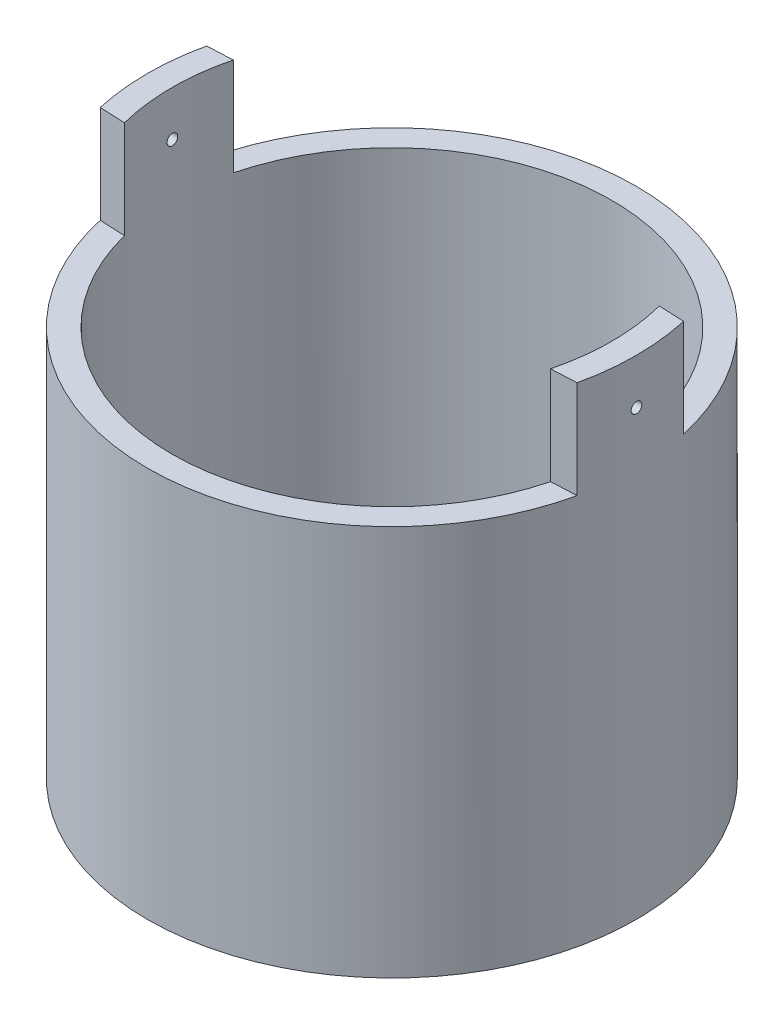
ISO-10303-21;
HEADER;
FILE_DESCRIPTION(('STEP AP214'),'2;1');
FILE_NAME('part.step','',(''),(''),'','','');
FILE_SCHEMA(('AUTOMOTIVE_DESIGN { 1 0 10303 214 1 1 1 1 }'));
ENDSEC;
DATA;
#1=APPLICATION_CONTEXT('core data for automotive mechanical design processes');
#2=APPLICATION_PROTOCOL_DEFINITION('international standard','automotive_design',2000,#1);
#3=PRODUCT_CONTEXT('',#1,'mechanical');
#4=PRODUCT('Part','Part','',(#3));
#5=PRODUCT_RELATED_PRODUCT_CATEGORY('part','',(#4));
#6=PRODUCT_DEFINITION_FORMATION('','',#4);
#7=PRODUCT_DEFINITION_CONTEXT('part definition',#1,'design');
#8=PRODUCT_DEFINITION('design','',#6,#7);
#9=PRODUCT_DEFINITION_SHAPE('','',#8);
#10=(LENGTH_UNIT() NAMED_UNIT(*) SI_UNIT(.MILLI.,.METRE.));
#11=(NAMED_UNIT(*) PLANE_ANGLE_UNIT() SI_UNIT($,.RADIAN.));
#12=(NAMED_UNIT(*) SI_UNIT($,.STERADIAN.) SOLID_ANGLE_UNIT());
#13=UNCERTAINTY_MEASURE_WITH_UNIT(LENGTH_MEASURE(1.E-05),#10,'distance_accuracy_value','');
#14=(GEOMETRIC_REPRESENTATION_CONTEXT(3) GLOBAL_UNCERTAINTY_ASSIGNED_CONTEXT((#13)) GLOBAL_UNIT_ASSIGNED_CONTEXT((#10,
#11,#12)) REPRESENTATION_CONTEXT('',''));
#15=CARTESIAN_POINT('',(0.,0.,0.));
#16=DIRECTION('',(0.,0.,1.));
#17=DIRECTION('',(1.,0.,0.));
#18=AXIS2_PLACEMENT_3D('',#15,#16,#17);
#19=CARTESIAN_POINT('',(0.,101.6,0.));
#20=DIRECTION('',(0.,1.,0.));
#21=DIRECTION('',(0.,0.,1.));
#22=AXIS2_PLACEMENT_3D('',#19,#20,#21);
#23=PLANE('',#22);
#24=CARTESIAN_POINT('',(0.,101.6,0.));
#25=DIRECTION('',(0.,1.,0.));
#26=DIRECTION('',(0.,0.,1.));
#27=AXIS2_PLACEMENT_3D('',#24,#25,#26);
#28=CIRCLE('',#27,57.15);
#29=CARTESIAN_POINT('',(55.372,101.6,-14.1444022850031));
#30=VERTEX_POINT('',#29);
#31=CARTESIAN_POINT('',(-55.372,101.6,-14.1444022850031));
#32=VERTEX_POINT('',#31);
#33=EDGE_CURVE('E180',#30,#32,#28,.T.);
#34=ORIENTED_EDGE('',*,*,#33,.F.);
#35=DIRECTION('',(-0.998857347475172,0.,-0.0477912062503406));
#36=VECTOR('',#35,1.);
#37=CARTESIAN_POINT('',(55.372,101.6,-14.1444022850031));
#38=LINE('',#37,#36);
#39=CARTESIAN_POINT('',(61.976,101.6,-13.8284281102373));
#40=VERTEX_POINT('',#39);
#41=EDGE_CURVE('E239',#40,#30,#38,.T.);
#42=ORIENTED_EDGE('',*,*,#41,.F.);
#43=CARTESIAN_POINT('',(0.,101.6,0.));
#44=DIRECTION('',(0.,1.,0.));
#45=DIRECTION('',(0.,0.,1.));
#46=AXIS2_PLACEMENT_3D('',#43,#44,#45);
#47=CIRCLE('',#46,63.5);
#48=CARTESIAN_POINT('',(-61.976,101.6,-13.8284281102373));
#49=VERTEX_POINT('',#48);
#50=EDGE_CURVE('E139',#40,#49,#47,.T.);
#51=ORIENTED_EDGE('',*,*,#50,.T.);
#52=DIRECTION('',(-0.998857347475172,0.,0.04779120625034));
#53=VECTOR('',#52,1.);
#54=CARTESIAN_POINT('',(-61.976,101.6,-13.8284281102373));
#55=LINE('',#54,#53);
#56=EDGE_CURVE('E144',#32,#49,#55,.T.);
#57=ORIENTED_EDGE('',*,*,#56,.F.);
#58=EDGE_LOOP('',(#34,#42,#51,#57));
#59=FACE_BOUND('',#58,.T.);
#60=ADVANCED_FACE('F39',(#59),#23,.T.);
#61=CARTESIAN_POINT('',(-61.976,101.6,13.8284281102373));
#62=VERTEX_POINT('',#61);
#63=CARTESIAN_POINT('',(61.976,101.6,13.8284281102373));
#64=VERTEX_POINT('',#63);
#65=EDGE_CURVE('E185',#62,#64,#47,.T.);
#66=ORIENTED_EDGE('',*,*,#65,.T.);
#67=DIRECTION('',(0.998857347475172,0.,-0.0477912062503403));
#68=VECTOR('',#67,1.);
#69=CARTESIAN_POINT('',(55.372,101.6,14.1444022850031));
#70=LINE('',#69,#68);
#71=CARTESIAN_POINT('',(55.372,101.6,14.1444022850031));
#72=VERTEX_POINT('',#71);
#73=EDGE_CURVE('E135',#72,#64,#70,.T.);
#74=ORIENTED_EDGE('',*,*,#73,.F.);
#75=CARTESIAN_POINT('',(-55.372,101.6,14.1444022850031));
#76=VERTEX_POINT('',#75);
#77=EDGE_CURVE('E181',#76,#72,#28,.T.);
#78=ORIENTED_EDGE('',*,*,#77,.F.);
#79=DIRECTION('',(0.998857347475172,0.,0.0477912062503403));
#80=VECTOR('',#79,1.);
#81=CARTESIAN_POINT('',(-61.976,101.6,13.8284281102373));
#82=LINE('',#81,#80);
#83=EDGE_CURVE('E71',#62,#76,#82,.T.);
#84=ORIENTED_EDGE('',*,*,#83,.F.);
#85=EDGE_LOOP('',(#66,#74,#78,#84));
#86=FACE_BOUND('',#85,.T.);
#87=ADVANCED_FACE('F263',(#86),#23,.T.);
#88=CARTESIAN_POINT('',(0.,76.2,0.));
#89=DIRECTION('',(0.,-1.,0.));
#90=DIRECTION('',(0.,0.,-1.));
#91=AXIS2_PLACEMENT_3D('',#88,#89,#90);
#92=CYLINDRICAL_SURFACE('',#91,63.5);
#93=CARTESIAN_POINT('',(-63.4829647073842,115.21931920527,-1.47077937195123));
#94=CARTESIAN_POINT('',(-63.4829649170925,115.297331986657,-1.47077591515681));
#95=CARTESIAN_POINT('',(-63.4831185422767,115.375401098312,-1.46418526018484));
#96=CARTESIAN_POINT('',(-63.4837172996637,115.529388529426,-1.43798570784439));
#97=CARTESIAN_POINT('',(-63.4841627813181,115.605304156602,-1.41836120413006));
#98=CARTESIAN_POINT('',(-63.485296902786,115.752731446426,-1.36665361274431));
#99=CARTESIAN_POINT('',(-63.4859854247434,115.824245223933,-1.33457656286518));
#100=CARTESIAN_POINT('',(-63.4875313714612,115.960852664148,-1.25888298148324));
#101=CARTESIAN_POINT('',(-63.4883887546358,116.025947901654,-1.21526929023364));
#102=CARTESIAN_POINT('',(-63.4901808797775,116.147912022489,-1.11772312183544));
#103=CARTESIAN_POINT('',(-63.4911156426295,116.204778673452,-1.06378785368757));
#104=CARTESIAN_POINT('',(-63.4929628617955,116.308652856521,-0.947133921893063));
#105=CARTESIAN_POINT('',(-63.4938753172224,116.35565999712,-0.88441490962106));
#106=CARTESIAN_POINT('',(-63.4955819366929,116.438482961545,-0.751967183493351));
#107=CARTESIAN_POINT('',(-63.4963760881291,116.474297593055,-0.682237723873613));
#108=CARTESIAN_POINT('',(-63.4977640155992,116.533711202493,-0.537753798982038));
#109=CARTESIAN_POINT('',(-63.4983577922382,116.557310217303,-0.462999348882912));
#110=CARTESIAN_POINT('',(-63.4992860621805,116.59161911204,-0.310599660523662));
#111=CARTESIAN_POINT('',(-63.4996205958863,116.602331000532,-0.232954874691712));
#112=CARTESIAN_POINT('',(-63.5000012442132,116.610567548529,-0.0769684573589591));
#113=CARTESIAN_POINT('',(-63.500047359721,116.608092248566,0.00137317199924745));
#114=CARTESIAN_POINT('',(-63.4998544973983,116.590026464947,0.15651375468178));
#115=CARTESIAN_POINT('',(-63.499615573923,116.574438481967,0.233312999290265));
#116=CARTESIAN_POINT('',(-63.498887984922,116.530593483407,0.383204490130935));
#117=CARTESIAN_POINT('',(-63.498399319021,116.502336448791,0.456296730793354));
#118=CARTESIAN_POINT('',(-63.4972352056706,116.433953734111,0.596704537815111));
#119=CARTESIAN_POINT('',(-63.4965597467644,116.393827326034,0.664019749511746));
#120=CARTESIAN_POINT('',(-63.4951054780516,116.302845454613,0.79095909274559));
#121=CARTESIAN_POINT('',(-63.4943266681456,116.251989980957,0.850583216891742));
#122=CARTESIAN_POINT('',(-63.4927597644046,116.140981369302,0.960460508461691));
#123=CARTESIAN_POINT('',(-63.4919716687211,116.080826350288,1.01071177549607));
#124=CARTESIAN_POINT('',(-63.4904806512518,115.952932916896,1.1004023407974));
#125=CARTESIAN_POINT('',(-63.4897777294862,115.885194500706,1.13984163648138));
#126=CARTESIAN_POINT('',(-63.4885405920076,115.744054827638,1.20678919209859));
#127=CARTESIAN_POINT('',(-63.4880063800995,115.670653443095,1.23429718295892));
#128=CARTESIAN_POINT('',(-63.4871699326888,115.520272950025,1.2765991400696));
#129=CARTESIAN_POINT('',(-63.4868676968826,115.443293846182,1.29139312296072));
#130=CARTESIAN_POINT('',(-63.486530939211,115.287958121665,1.30784499600895));
#131=CARTESIAN_POINT('',(-63.4864963685989,115.20960175442,1.30950527804917));
#132=CARTESIAN_POINT('',(-63.4866988922572,115.053722611096,1.29964884883673));
#133=CARTESIAN_POINT('',(-63.4869359863866,114.976199834584,1.28813214442527));
#134=CARTESIAN_POINT('',(-63.487653814155,114.824195374215,1.25225069774117));
#135=CARTESIAN_POINT('',(-63.4881345265495,114.749713425796,1.22788707577325));
#136=CARTESIAN_POINT('',(-63.4892827345872,114.60589680768,1.16700450821196));
#137=CARTESIAN_POINT('',(-63.4899502304042,114.536562142769,1.13048555132129));
#138=CARTESIAN_POINT('',(-63.4913929124932,114.404996944793,1.04632257613725));
#139=CARTESIAN_POINT('',(-63.4921681148115,114.342767472783,0.998676899461541));
#140=CARTESIAN_POINT('',(-63.4937335827857,114.227189838234,0.893615375324416));
#141=CARTESIAN_POINT('',(-63.4945238484626,114.173841687994,0.836199514333427));
#142=CARTESIAN_POINT('',(-63.4960242521264,114.077533417095,0.713217508286191));
#143=CARTESIAN_POINT('',(-63.4967343786027,114.034574787695,0.647650195255195));
#144=CARTESIAN_POINT('',(-63.4979871949173,113.960275327068,0.510232556254644));
#145=CARTESIAN_POINT('',(-63.4985298850537,113.928934475143,0.438382241478661));
#146=CARTESIAN_POINT('',(-63.4993787975204,113.878763514918,0.290445758493135));
#147=CARTESIAN_POINT('',(-63.4996850440183,113.859932128014,0.214360024051559));
#148=CARTESIAN_POINT('',(-63.5000183739547,113.835310198931,0.0601062710330311));
#149=CARTESIAN_POINT('',(-63.5000454572679,113.829519662611,-0.0180617484794858));
#150=CARTESIAN_POINT('',(-63.4998089452234,113.83114378649,-0.174244637706082));
#151=CARTESIAN_POINT('',(-63.4995454068455,113.838555858333,-0.252259534437949));
#152=CARTESIAN_POINT('',(-63.4987489797217,113.866369303255,-0.405937171022538));
#153=CARTESIAN_POINT('',(-63.4982160903944,113.886770704371,-0.481599905797745));
#154=CARTESIAN_POINT('',(-63.4969327750511,113.939984149699,-0.628429212635925));
#155=CARTESIAN_POINT('',(-63.4961823394083,113.972796743156,-0.699595585553926));
#156=CARTESIAN_POINT('',(-63.4945408111034,114.049899462879,-0.835407252536742));
#157=CARTESIAN_POINT('',(-63.4936497237177,114.094189158637,-0.900052791072389));
#158=CARTESIAN_POINT('',(-63.4918201405713,114.192995269429,-1.0209998754314));
#159=CARTESIAN_POINT('',(-63.490881639247,114.247512886651,-1.07730043899384));
#160=CARTESIAN_POINT('',(-63.4890567542825,114.365242474952,-1.17996462741543));
#161=CARTESIAN_POINT('',(-63.4881703836254,114.428456598901,-1.22632578442453));
#162=CARTESIAN_POINT('',(-63.4865444708081,114.561802289011,-1.30779884590625));
#163=CARTESIAN_POINT('',(-63.485805010538,114.631937680769,-1.34290448304512));
#164=CARTESIAN_POINT('',(-63.4845540343314,114.77705405411,-1.40080177814973));
#165=CARTESIAN_POINT('',(-63.4840422459748,114.852029121061,-1.4236081597242));
#166=CARTESIAN_POINT('',(-63.4834389415865,114.976119753696,-1.45019901186818));
#167=CARTESIAN_POINT('',(-63.4832618428377,115.024429372553,-1.45790697155806));
#168=CARTESIAN_POINT('',(-63.4830246600559,115.1215916929,-1.4681982339878));
#169=CARTESIAN_POINT('',(-63.4829645760025,115.170444394295,-1.47078153762423));
#170=CARTESIAN_POINT('',(-63.4829647073842,115.21931920527,-1.47077937195123));
#171=B_SPLINE_CURVE_WITH_KNOTS('',3,(#93,#94,#95,#96,#97,#98,#99,#100,#101,#102,#103,#104,#105,
#106,#107,#108,#109,#110,#111,#112,#113,#114,#115,#116,#117,#118,#119,#120,#121,#122,#123,#124,
#125,#126,#127,#128,#129,#130,#131,#132,#133,#134,#135,#136,#137,#138,#139,#140,#141,#142,#143,
#144,#145,#146,#147,#148,#149,#150,#151,#152,#153,#154,#155,#156,#157,#158,#159,#160,#161,#162,
#163,#164,#165,#166,#167,#168,#169,#170),.UNSPECIFIED.,.T.,.F.,(4,2,2,2,2,2,2,2,2,2,2,2,2,2,2,2,
2,2,2,2,2,2,2,2,2,2,2,2,2,2,2,2,2,2,2,2,2,2,4),(0.,0.233859944263324,0.468000411564756,
0.702027494072429,0.935997014027852,1.1700298899829,1.40407205729837,1.63813914817078,
1.87220553232085,2.10623543054921,2.34026460945024,2.57424916751861,2.80823407713788,
3.04223334127149,3.27623283027436,3.51027971228622,3.74432665021161,3.97837886605199,
4.21243077555184,4.44644005900852,4.68044922097281,4.91443797973758,5.14842695597483,
5.3824508293905,5.61647502688091,5.85053279508485,6.08459014630834,6.31862357063275,
6.5526571001096,6.78664475265158,7.02063291025779,7.25463142400269,7.48862116170971,
7.72263841978262,7.95671371475867,8.19091912281899,8.42484353445192,8.57135622592236,
8.71786889176039),.UNSPECIFIED.);
#172=CARTESIAN_POINT('',(-63.4829647073842,115.21931920527,-1.47077937195123));
#173=VERTEX_POINT('',#172);
#174=EDGE_CURVE('E233',#173,#173,#171,.T.);
#175=ORIENTED_EDGE('',*,*,#174,.T.);
#176=EDGE_LOOP('',(#175));
#177=FACE_BOUND('',#176,.T.);
#178=CARTESIAN_POINT('',(63.4829647073851,115.21931920527,-1.47077937195123));
#179=CARTESIAN_POINT('',(63.4829649170936,115.141306423883,-1.47077591515681));
#180=CARTESIAN_POINT('',(63.483118542277,115.063237312227,-1.46418526018484));
#181=CARTESIAN_POINT('',(63.4837172996634,114.909249881114,-1.43798570784439));
#182=CARTESIAN_POINT('',(63.484162781318,114.833334253938,-1.41836120413006));
#183=CARTESIAN_POINT('',(63.4852969027861,114.685906964114,-1.36665361274431));
#184=CARTESIAN_POINT('',(63.4859854247434,114.614393186606,-1.33457656286518));
#185=CARTESIAN_POINT('',(63.4875313714612,114.477785746392,-1.25888298148324));
#186=CARTESIAN_POINT('',(63.4883887546358,114.412690508886,-1.21526929023364));
#187=CARTESIAN_POINT('',(63.4901808797775,114.29072638805,-1.11772312183544));
#188=CARTESIAN_POINT('',(63.4911156426295,114.233859737088,-1.06378785368757));
#189=CARTESIAN_POINT('',(63.4929628617955,114.129985554019,-0.947133921893059));
#190=CARTESIAN_POINT('',(63.4938753172224,114.08297841342,-0.884414909621056));
#191=CARTESIAN_POINT('',(63.4955819366929,114.000155448995,-0.751967183493349));
#192=CARTESIAN_POINT('',(63.4963760881291,113.964340817485,-0.68223772387361));
#193=CARTESIAN_POINT('',(63.4977640155992,113.904927208047,-0.537753798982032));
#194=CARTESIAN_POINT('',(63.4983577922382,113.881328193237,-0.462999348882904));
#195=CARTESIAN_POINT('',(63.4992860621805,113.8470192985,-0.310599660523653));
#196=CARTESIAN_POINT('',(63.4996205958863,113.836307410007,-0.232954874691704));
#197=CARTESIAN_POINT('',(63.5000012442132,113.828070862011,-0.0769684573589526));
#198=CARTESIAN_POINT('',(63.500047359721,113.830546161973,0.00137317199925241));
#199=CARTESIAN_POINT('',(63.4998544973983,113.848611945593,0.156513754681784));
#200=CARTESIAN_POINT('',(63.499615573923,113.864199928573,0.23331299929027));
#201=CARTESIAN_POINT('',(63.498887984922,113.908044927133,0.383204490130937));
#202=CARTESIAN_POINT('',(63.498399319021,113.936301961748,0.456296730793353));
#203=CARTESIAN_POINT('',(63.4972352056706,114.004684676429,0.596704537815115));
#204=CARTESIAN_POINT('',(63.4965597467644,114.044811084506,0.664019749511759));
#205=CARTESIAN_POINT('',(63.4951054780516,114.135792955927,0.790959092745603));
#206=CARTESIAN_POINT('',(63.4943266681456,114.186648429582,0.850583216891745));
#207=CARTESIAN_POINT('',(63.4927597644046,114.297657041238,0.96046050846169));
#208=CARTESIAN_POINT('',(63.4919716687211,114.357812060251,1.01071177549608));
#209=CARTESIAN_POINT('',(63.4904806512518,114.485705493643,1.10040234079741));
#210=CARTESIAN_POINT('',(63.4897777294862,114.553443909834,1.13984163648139));
#211=CARTESIAN_POINT('',(63.4885405920076,114.694583582901,1.20678919209859));
#212=CARTESIAN_POINT('',(63.4880063800995,114.767984967445,1.23429718295892));
#213=CARTESIAN_POINT('',(63.4871699326888,114.918365460515,1.2765991400696));
#214=CARTESIAN_POINT('',(63.4868676968826,114.995344564357,1.29139312296072));
#215=CARTESIAN_POINT('',(63.486530939211,115.150680288875,1.30784499600895));
#216=CARTESIAN_POINT('',(63.4864963685989,115.229036656119,1.30950527804917));
#217=CARTESIAN_POINT('',(63.4866988922572,115.384915799443,1.29964884883674));
#218=CARTESIAN_POINT('',(63.4869359863866,115.462438575956,1.28813214442528));
#219=CARTESIAN_POINT('',(63.487653814155,115.614443036324,1.25225069774117));
#220=CARTESIAN_POINT('',(63.4881345265495,115.688924984744,1.22788707577325));
#221=CARTESIAN_POINT('',(63.4892827345872,115.832741602859,1.16700450821196));
#222=CARTESIAN_POINT('',(63.4899502304042,115.902076267771,1.13048555132129));
#223=CARTESIAN_POINT('',(63.4913929124932,116.033641465747,1.04632257613725));
#224=CARTESIAN_POINT('',(63.4921681148115,116.095870937757,0.998676899461538));
#225=CARTESIAN_POINT('',(63.4937335827857,116.211448572306,0.893615375324412));
#226=CARTESIAN_POINT('',(63.4945238484626,116.264796722546,0.836199514333424));
#227=CARTESIAN_POINT('',(63.4960242521264,116.361104993445,0.71321750828619));
#228=CARTESIAN_POINT('',(63.4967343786027,116.404063622845,0.647650195255195));
#229=CARTESIAN_POINT('',(63.4979871949173,116.478363083472,0.510232556254644));
#230=CARTESIAN_POINT('',(63.4985298850537,116.509703935397,0.43838224147866));
#231=CARTESIAN_POINT('',(63.4993787975204,116.559874895622,0.290445758493135));
#232=CARTESIAN_POINT('',(63.4996850440183,116.578706282525,0.214360024051559));
#233=CARTESIAN_POINT('',(63.5000183739547,116.603328211609,0.0601062710330305));
#234=CARTESIAN_POINT('',(63.5000454572679,116.609118747928,-0.0180617484794875));
#235=CARTESIAN_POINT('',(63.4998089452234,116.60749462405,-0.174244637706084));
#236=CARTESIAN_POINT('',(63.4995454068455,116.600082552207,-0.252259534437951));
#237=CARTESIAN_POINT('',(63.4987489797217,116.572269107285,-0.405937171022539));
#238=CARTESIAN_POINT('',(63.4982160903944,116.551867706169,-0.481599905797747));
#239=CARTESIAN_POINT('',(63.4969327750511,116.498654260841,-0.628429212635928));
#240=CARTESIAN_POINT('',(63.4961823394083,116.465841667384,-0.69959558555393));
#241=CARTESIAN_POINT('',(63.4945408111034,116.388738947661,-0.835407252536746));
#242=CARTESIAN_POINT('',(63.4936497237177,116.344449251902,-0.900052791072392));
#243=CARTESIAN_POINT('',(63.4918201405713,116.24564314111,-1.0209998754314));
#244=CARTESIAN_POINT('',(63.490881639247,116.191125523889,-1.07730043899385));
#245=CARTESIAN_POINT('',(63.4890567542825,116.073395935588,-1.17996462741543));
#246=CARTESIAN_POINT('',(63.4881703836254,116.010181811639,-1.22632578442453));
#247=CARTESIAN_POINT('',(63.4865444708081,115.876836121529,-1.30779884590625));
#248=CARTESIAN_POINT('',(63.485805010538,115.806700729771,-1.34290448304512));
#249=CARTESIAN_POINT('',(63.4845540343314,115.66158435643,-1.40080177814973));
#250=CARTESIAN_POINT('',(63.4840422459749,115.586609289478,-1.4236081597242));
#251=CARTESIAN_POINT('',(63.4834389415864,115.462518656843,-1.45019901186818));
#252=CARTESIAN_POINT('',(63.4832618428375,115.414209037987,-1.45790697155806));
#253=CARTESIAN_POINT('',(63.4830246600561,115.31704671764,-1.46819823398781));
#254=CARTESIAN_POINT('',(63.4829645760032,115.268194016245,-1.47078153762423));
#255=CARTESIAN_POINT('',(63.4829647073851,115.21931920527,-1.47077937195123));
#256=B_SPLINE_CURVE_WITH_KNOTS('',3,(#178,#179,#180,#181,#182,#183,#184,#185,#186,#187,#188,
#189,#190,#191,#192,#193,#194,#195,#196,#197,#198,#199,#200,#201,#202,#203,#204,#205,#206,#207,
#208,#209,#210,#211,#212,#213,#214,#215,#216,#217,#218,#219,#220,#221,#222,#223,#224,#225,#226,
#227,#228,#229,#230,#231,#232,#233,#234,#235,#236,#237,#238,#239,#240,#241,#242,#243,#244,#245,
#246,#247,#248,#249,#250,#251,#252,#253,#254,#255),.UNSPECIFIED.,.T.,.F.,(4,2,2,2,2,2,2,2,2,2,2,
2,2,2,2,2,2,2,2,2,2,2,2,2,2,2,2,2,2,2,2,2,2,2,2,2,2,2,4),(0.,0.233859944263323,
0.468000411564754,0.702027494072427,0.93599701402785,1.17002988998291,1.40407205729837,
1.63813914817078,1.87220553232086,2.10623543054922,2.34026460945024,2.57424916751862,
2.80823407713789,3.0422333412715,3.27623283027437,3.51027971228623,3.74432665021161,
3.97837886605198,4.21243077555183,4.44644005900849,4.68044922097281,4.91443797973756,
5.14842695597482,5.38245082939051,5.6164750268809,5.85053279508485,6.08459014630834,
6.31862357063274,6.5526571001096,6.78664475265158,7.0206329102578,7.25463142400269,
7.48862116170972,7.72263841978264,7.95671371475867,8.19091912281899,8.42484353445192,
8.57135622592239,8.71786889176039),.UNSPECIFIED.);
#257=CARTESIAN_POINT('',(63.4829647073851,115.21931920527,-1.47077937195123));
#258=VERTEX_POINT('',#257);
#259=EDGE_CURVE('E227',#258,#258,#256,.T.);
#260=ORIENTED_EDGE('',*,*,#259,.T.);
#261=EDGE_LOOP('',(#260));
#262=FACE_BOUND('',#261,.T.);
#263=CARTESIAN_POINT('',(0.,0.,0.));
#264=DIRECTION('',(0.,1.,0.));
#265=DIRECTION('',(0.,0.,1.));
#266=AXIS2_PLACEMENT_3D('',#263,#264,#265);
#267=CIRCLE('',#266,63.5);
#268=CARTESIAN_POINT('',(0.,0.,63.5));
#269=VERTEX_POINT('',#268);
#270=EDGE_CURVE('E55',#269,#269,#267,.T.);
#271=ORIENTED_EDGE('',*,*,#270,.T.);
#272=EDGE_LOOP('',(#271));
#273=FACE_BOUND('',#272,.T.);
#274=ORIENTED_EDGE('',*,*,#65,.F.);
#275=DIRECTION('',(0.,-1.,0.));
#276=VECTOR('',#275,1.);
#277=CARTESIAN_POINT('',(-61.976,127.,13.8284281102373));
#278=LINE('',#277,#276);
#279=CARTESIAN_POINT('',(-61.976,127.,13.8284281102373));
#280=VERTEX_POINT('',#279);
#281=EDGE_CURVE('E176',#280,#62,#278,.T.);
#282=ORIENTED_EDGE('',*,*,#281,.F.);
#283=CARTESIAN_POINT('',(0.,127.,0.));
#284=DIRECTION('',(0.,1.,0.));
#285=DIRECTION('',(0.,0.,1.));
#286=AXIS2_PLACEMENT_3D('',#283,#284,#285);
#287=CIRCLE('',#286,63.5);
#288=CARTESIAN_POINT('',(-61.976,127.,-13.8284281102373));
#289=VERTEX_POINT('',#288);
#290=EDGE_CURVE('E149',#289,#280,#287,.T.);
#291=ORIENTED_EDGE('',*,*,#290,.F.);
#292=DIRECTION('',(0.,-1.,0.));
#293=VECTOR('',#292,1.);
#294=CARTESIAN_POINT('',(-61.976,127.,-13.8284281102373));
#295=LINE('',#294,#293);
#296=EDGE_CURVE('E161',#289,#49,#295,.T.);
#297=ORIENTED_EDGE('',*,*,#296,.T.);
#298=ORIENTED_EDGE('',*,*,#50,.F.);
#299=DIRECTION('',(0.,-1.,0.));
#300=VECTOR('',#299,1.);
#301=CARTESIAN_POINT('',(61.976,127.,-13.8284281102373));
#302=LINE('',#301,#300);
#303=CARTESIAN_POINT('',(61.976,127.,-13.8284281102373));
#304=VERTEX_POINT('',#303);
#305=EDGE_CURVE('E118',#304,#40,#302,.T.);
#306=ORIENTED_EDGE('',*,*,#305,.F.);
#307=CARTESIAN_POINT('',(0.,127.,0.));
#308=DIRECTION('',(0.,1.,0.));
#309=DIRECTION('',(0.,0.,-1.));
#310=AXIS2_PLACEMENT_3D('',#307,#308,#309);
#311=CIRCLE('',#310,63.5);
#312=CARTESIAN_POINT('',(61.976,127.,13.8284281102373));
#313=VERTEX_POINT('',#312);
#314=EDGE_CURVE('E126',#313,#304,#311,.T.);
#315=ORIENTED_EDGE('',*,*,#314,.F.);
#316=DIRECTION('',(0.,-1.,0.));
#317=VECTOR('',#316,1.);
#318=CARTESIAN_POINT('',(61.976,127.,13.8284281102373));
#319=LINE('',#318,#317);
#320=EDGE_CURVE('E245',#313,#64,#319,.T.);
#321=ORIENTED_EDGE('',*,*,#320,.T.);
#322=EDGE_LOOP('',(#274,#282,#291,#297,#298,#306,#315,#321));
#323=FACE_BOUND('',#322,.T.);
#324=ADVANCED_FACE('F41',(#177,#262,#273,#323),#92,.T.);
#325=CARTESIAN_POINT('',(0.,0.,0.));
#326=DIRECTION('',(0.,1.,0.));
#327=DIRECTION('',(0.,0.,1.));
#328=AXIS2_PLACEMENT_3D('',#325,#326,#327);
#329=PLANE('',#328);
#330=CARTESIAN_POINT('',(0.,0.,0.));
#331=DIRECTION('',(0.,-1.,0.));
#332=DIRECTION('',(0.,0.,-1.));
#333=AXIS2_PLACEMENT_3D('',#330,#331,#332);
#334=CIRCLE('',#333,25.4);
#335=CARTESIAN_POINT('',(0.,0.,-25.4));
#336=VERTEX_POINT('',#335);
#337=EDGE_CURVE('E11',#336,#336,#334,.T.);
#338=ORIENTED_EDGE('',*,*,#337,.F.);
#339=EDGE_LOOP('',(#338));
#340=FACE_BOUND('',#339,.T.);
#341=ORIENTED_EDGE('',*,*,#270,.F.);
#342=EDGE_LOOP('',(#341));
#343=FACE_BOUND('',#342,.T.);
#344=ADVANCED_FACE('F262',(#340,#343),#329,.F.);
#345=CARTESIAN_POINT('',(0.,6.35000000000001,0.));
#346=DIRECTION('',(0.,1.,0.));
#347=DIRECTION('',(0.,0.,1.));
#348=AXIS2_PLACEMENT_3D('',#345,#346,#347);
#349=CYLINDRICAL_SURFACE('',#348,57.15);
#350=CARTESIAN_POINT('',(-57.1310713013422,115.21931920527,-1.47077937195123));
#351=CARTESIAN_POINT('',(-57.131071534292,115.141309114393,-1.47077591590676));
#352=CARTESIAN_POINT('',(-57.1312422280716,115.063242750641,-1.46418571324732));
#353=CARTESIAN_POINT('',(-57.1319075072892,114.90926091048,-1.43798805764897));
#354=CARTESIAN_POINT('',(-57.1324024806325,114.833348123801,-1.41836501435539));
#355=CARTESIAN_POINT('',(-57.1336625919195,114.685926527702,-1.36666152750461));
#356=CARTESIAN_POINT('',(-57.1344275984744,114.614415596329,-1.33458714158275));
#357=CARTESIAN_POINT('',(-57.1361452714156,114.477813296389,-1.25890008440875));
#358=CARTESIAN_POINT('',(-57.1370978917088,114.412720356935,-1.21529024628363));
#359=CARTESIAN_POINT('',(-57.1390891252625,114.290757438987,-1.11775087165657));
#360=CARTESIAN_POINT('',(-57.140127765069,114.233890013915,-1.06381814266948));
#361=CARTESIAN_POINT('',(-57.1421802704837,114.130013658497,-0.947169195056444));
#362=CARTESIAN_POINT('',(-57.143194135104,114.08300512065,-0.884452626895875));
#363=CARTESIAN_POINT('',(-57.145090473187,114.000177452962,-0.752007361174526));
#364=CARTESIAN_POINT('',(-57.1459729287802,113.964359844168,-0.682277712111201));
#365=CARTESIAN_POINT('',(-57.1475152009991,113.904940508224,-0.537792420802112));
#366=CARTESIAN_POINT('',(-57.1481750183496,113.881338741299,-0.463036794921573));
#367=CARTESIAN_POINT('',(-57.1492065321497,113.847025523887,-0.310636715696705));
#368=CARTESIAN_POINT('',(-57.1495782841452,113.836311588098,-0.23299282230674));
#369=CARTESIAN_POINT('',(-57.150001328777,113.828070759645,-0.077007676559521));
#370=CARTESIAN_POINT('',(-57.1500526224939,113.830543822515,0.00133357344544507));
#371=CARTESIAN_POINT('',(-57.1498384446636,113.848604605409,0.156470214394535));
#372=CARTESIAN_POINT('',(-57.1495730477026,113.864189237174,0.233265964999865));
#373=CARTESIAN_POINT('',(-57.1487647793881,113.908026237433,0.383151073208096));
#374=CARTESIAN_POINT('',(-57.1482219075888,113.93627862628,0.456240424855444));
#375=CARTESIAN_POINT('',(-57.1469286176268,114.004651295344,0.596644383292428));
#376=CARTESIAN_POINT('',(-57.1461781837408,114.044772474669,0.663958552090739));
#377=CARTESIAN_POINT('',(-57.1445624538345,114.135743165103,0.790896945077914));
#378=CARTESIAN_POINT('',(-57.1436971576671,114.186592689957,0.850521159414499));
#379=CARTESIAN_POINT('',(-57.141956161884,114.297591715422,0.960402728347279));
#380=CARTESIAN_POINT('',(-57.1410804597216,114.357743537887,1.01065773746422));
#381=CARTESIAN_POINT('',(-57.1394236493916,114.485631422642,1.10035637265939));
#382=CARTESIAN_POINT('',(-57.1386425412491,114.553367486941,1.13979999587346));
#383=CARTESIAN_POINT('',(-57.1372677427804,114.694503923677,1.20675679158578));
#384=CARTESIAN_POINT('',(-57.1366740576869,114.767904454192,1.23426963098864));
#385=CARTESIAN_POINT('',(-57.1357444340698,114.918284383408,1.27658123146758));
#386=CARTESIAN_POINT('',(-57.1354084951323,114.995263776363,1.29138001295796));
#387=CARTESIAN_POINT('',(-57.1350341012935,115.150597697313,1.30784079649427));
#388=CARTESIAN_POINT('',(-57.1349955795252,115.228951912244,1.30950575136209));
#389=CARTESIAN_POINT('',(-57.1352203898617,115.384827524233,1.29965931030737));
#390=CARTESIAN_POINT('',(-57.1354837217698,115.462348921834,1.28814792297165));
#391=CARTESIAN_POINT('',(-57.1362811010838,115.61434982336,1.2522780789397));
#392=CARTESIAN_POINT('',(-57.1368151193274,115.688829654033,1.22792100615949));
#393=CARTESIAN_POINT('',(-57.1380907066572,115.832643211926,1.16705257829293));
#394=CARTESIAN_POINT('',(-57.1388322759877,115.901976933086,1.13054120889395));
#395=CARTESIAN_POINT('',(-57.1404351289264,116.033544106212,1.04639273445997));
#396=CARTESIAN_POINT('',(-57.1412964345521,116.095776248476,0.998753582115143));
#397=CARTESIAN_POINT('',(-57.1430358304139,116.211360503391,0.893704807359265));
#398=CARTESIAN_POINT('',(-57.1439139206771,116.2647126017,0.836295169168317));
#399=CARTESIAN_POINT('',(-57.145581152909,116.361031744813,0.713322790947779));
#400=CARTESIAN_POINT('',(-57.1463702790995,116.403996949012,0.647758609008739));
#401=CARTESIAN_POINT('',(-57.1477625290986,116.478309943964,0.5103457144834));
#402=CARTESIAN_POINT('',(-57.1483656532702,116.509657757387,0.438497014160983));
#403=CARTESIAN_POINT('',(-57.1493091703527,116.55984204841,0.290563967226226));
#404=CARTESIAN_POINT('',(-57.1496495963705,116.578680102527,0.214480155645411));
#405=CARTESIAN_POINT('',(-57.1500202845851,116.603315619724,0.0602289720192637));
#406=CARTESIAN_POINT('',(-57.1500505467411,116.609113081085,-0.0179384003009577));
#407=CARTESIAN_POINT('',(-57.1497880994029,116.607502883108,-0.174117491888123));
#408=CARTESIAN_POINT('',(-57.1494954679275,116.600098413404,-0.252129244194722));
#409=CARTESIAN_POINT('',(-57.148610932776,116.572301319853,-0.405801765666485));
#410=CARTESIAN_POINT('',(-57.1480190284436,116.551908667531,-0.48146252967703));
#411=CARTESIAN_POINT('',(-57.1465934863739,116.498713619971,-0.62828973466698));
#412=CARTESIAN_POINT('',(-57.1457598365102,116.465910602189,-0.699455949976311));
#413=CARTESIAN_POINT('',(-57.1439361958837,116.388827724821,-0.83526905010434));
#414=CARTESIAN_POINT('',(-57.1429462109213,116.344548290994,-0.899916176648971));
#415=CARTESIAN_POINT('',(-57.1409134271784,116.245760360683,-1.02087174024029));
#416=CARTESIAN_POINT('',(-57.1398706194632,116.191250129474,-1.07717876024497));
#417=CARTESIAN_POINT('',(-57.1378428195988,116.073534070351,-1.17985715976033));
#418=CARTESIAN_POINT('',(-57.1368578418447,116.010326090358,-1.22622607300613));
#419=CARTESIAN_POINT('',(-57.1350509322349,115.876989734547,-1.30771653396632));
#420=CARTESIAN_POINT('',(-57.1342290943538,115.806857404667,-1.34283160615902));
#421=CARTESIAN_POINT('',(-57.1328386499669,115.661744978437,-1.40074801644744));
#422=CARTESIAN_POINT('',(-57.1322697410065,115.586770795615,-1.42356406879818));
#423=CARTESIAN_POINT('',(-57.1315988507795,115.462654409473,-1.4501758601501));
#424=CARTESIAN_POINT('',(-57.131401842786,115.414318231986,-1.45789248058772));
#425=CARTESIAN_POINT('',(-57.1311379950665,115.317101809171,-1.46819531918166));
#426=CARTESIAN_POINT('',(-57.1310711553124,115.268221563962,-1.47078153844949));
#427=CARTESIAN_POINT('',(-57.1310713013422,115.21931920527,-1.47077937195123));
#428=B_SPLINE_CURVE_WITH_KNOTS('',3,(#350,#351,#352,#353,#354,#355,#356,#357,#358,#359,#360,
#361,#362,#363,#364,#365,#366,#367,#368,#369,#370,#371,#372,#373,#374,#375,#376,#377,#378,#379,
#380,#381,#382,#383,#384,#385,#386,#387,#388,#389,#390,#391,#392,#393,#394,#395,#396,#397,#398,
#399,#400,#401,#402,#403,#404,#405,#406,#407,#408,#409,#410,#411,#412,#413,#414,#415,#416,#417,
#418,#419,#420,#421,#422,#423,#424,#425,#426,#427),.UNSPECIFIED.,.T.,.F.,(4,2,2,2,2,2,2,2,2,2,2,
2,2,2,2,2,2,2,2,2,2,2,2,2,2,2,2,2,2,2,2,2,2,2,2,2,2,2,4),(0.,0.233851770531822,
0.467983788063989,0.702002041757586,0.935962873443076,1.16999617774076,1.40403879755482,
1.63811321414034,1.8721868685864,2.10621537681434,2.34024309592804,2.57421570830326,
2.80818869662067,3.04217941385161,3.27617043086571,3.51021994657552,3.74426952429008,
3.97832563601131,4.21238137192036,4.44638448458262,4.68038744474876,4.91436520000743,
5.1483432307941,5.38236434323985,5.61638583364684,5.85044876338198,6.08451123636667,
6.31854420650652,6.55257720752312,6.78655367301489,7.02053065147164,7.25451936852476,
7.48849940615092,7.72251915311914,7.9565969079286,8.19080911153592,8.42474048380844,
8.57133569363908,8.71793087170956),.UNSPECIFIED.);
#429=CARTESIAN_POINT('',(-57.1310713013422,115.21931920527,-1.47077937195123));
#430=VERTEX_POINT('',#429);
#431=EDGE_CURVE('E44',#430,#430,#428,.T.);
#432=ORIENTED_EDGE('',*,*,#431,.T.);
#433=EDGE_LOOP('',(#432));
#434=FACE_BOUND('',#433,.T.);
#435=CARTESIAN_POINT('',(57.1310713013422,115.21931920527,-1.47077937195123));
#436=CARTESIAN_POINT('',(57.131071534292,115.297329296147,-1.47077591590676));
#437=CARTESIAN_POINT('',(57.1312422280716,115.375395659899,-1.46418571324732));
#438=CARTESIAN_POINT('',(57.1319075072892,115.52937750006,-1.43798805764897));
#439=CARTESIAN_POINT('',(57.1324024806325,115.605290286738,-1.41836501435539));
#440=CARTESIAN_POINT('',(57.1336625919195,115.752711882838,-1.36666152750461));
#441=CARTESIAN_POINT('',(57.1344275984744,115.824222814211,-1.33458714158276));
#442=CARTESIAN_POINT('',(57.1361452714156,115.96082511415,-1.25890008440876));
#443=CARTESIAN_POINT('',(57.1370978917088,116.025918053605,-1.21529024628363));
#444=CARTESIAN_POINT('',(57.1390891252625,116.147880971553,-1.11775087165657));
#445=CARTESIAN_POINT('',(57.140127765069,116.204748396625,-1.06381814266948));
#446=CARTESIAN_POINT('',(57.1421802704837,116.308624752043,-0.947169195056444));
#447=CARTESIAN_POINT('',(57.143194135104,116.355633289889,-0.884452626895875));
#448=CARTESIAN_POINT('',(57.145090473187,116.438460957578,-0.752007361174526));
#449=CARTESIAN_POINT('',(57.1459729287802,116.474278566371,-0.682277712111201));
#450=CARTESIAN_POINT('',(57.1475152009991,116.533697902315,-0.537792420802112));
#451=CARTESIAN_POINT('',(57.1481750183496,116.55729966924,-0.463036794921573));
#452=CARTESIAN_POINT('',(57.1492065321497,116.591612886653,-0.310636715696705));
#453=CARTESIAN_POINT('',(57.1495782841452,116.602326822442,-0.232992822306741));
#454=CARTESIAN_POINT('',(57.150001328777,116.610567650895,-0.0770076765595215));
#455=CARTESIAN_POINT('',(57.1500526224939,116.608094588025,0.00133357344544478));
#456=CARTESIAN_POINT('',(57.1498384446636,116.590033805131,0.156470214394536));
#457=CARTESIAN_POINT('',(57.1495730477026,116.574449173365,0.233265964999868));
#458=CARTESIAN_POINT('',(57.1487647793881,116.530612173107,0.383151073208098));
#459=CARTESIAN_POINT('',(57.1482219075888,116.50235978426,0.456240424855446));
#460=CARTESIAN_POINT('',(57.1469286176268,116.433987115195,0.596644383292425));
#461=CARTESIAN_POINT('',(57.1461781837408,116.39386593587,0.663958552090734));
#462=CARTESIAN_POINT('',(57.1445624538345,116.302895245437,0.790896945077909));
#463=CARTESIAN_POINT('',(57.1436971576671,116.252045720583,0.850521159414497));
#464=CARTESIAN_POINT('',(57.141956161884,116.141046695118,0.960402728347279));
#465=CARTESIAN_POINT('',(57.1410804597216,116.080894872653,1.01065773746422));
#466=CARTESIAN_POINT('',(57.1394236493916,115.953006987898,1.10035637265939));
#467=CARTESIAN_POINT('',(57.1386425412491,115.885270923599,1.13979999587346));
#468=CARTESIAN_POINT('',(57.1372677427804,115.744134486863,1.20675679158579));
#469=CARTESIAN_POINT('',(57.1366740576869,115.670733956348,1.23426963098864));
#470=CARTESIAN_POINT('',(57.1357444340698,115.520354027132,1.27658123146759));
#471=CARTESIAN_POINT('',(57.1354084951323,115.443374634177,1.29138001295796));
#472=CARTESIAN_POINT('',(57.1350341012935,115.288040713226,1.30784079649427));
#473=CARTESIAN_POINT('',(57.1349955795252,115.209686498296,1.30950575136209));
#474=CARTESIAN_POINT('',(57.1352203898617,115.053810886307,1.29965931030737));
#475=CARTESIAN_POINT('',(57.1354837217698,114.976289488705,1.28814792297165));
#476=CARTESIAN_POINT('',(57.1362811010838,114.824288587179,1.2522780789397));
#477=CARTESIAN_POINT('',(57.1368151193274,114.749808756506,1.22792100615948));
#478=CARTESIAN_POINT('',(57.1380907066572,114.605995198613,1.16705257829292));
#479=CARTESIAN_POINT('',(57.1388322759877,114.536661477454,1.13054120889394));
#480=CARTESIAN_POINT('',(57.1404351289264,114.405094304328,1.04639273445997));
#481=CARTESIAN_POINT('',(57.1412964345521,114.342862162064,0.998753582115144));
#482=CARTESIAN_POINT('',(57.1430358304139,114.227277907148,0.893704807359264));
#483=CARTESIAN_POINT('',(57.1439139206771,114.17392580884,0.836295169168315));
#484=CARTESIAN_POINT('',(57.145581152909,114.077606665727,0.713322790947777));
#485=CARTESIAN_POINT('',(57.1463702790995,114.034641461528,0.647758609008737));
#486=CARTESIAN_POINT('',(57.1477625290986,113.960328466576,0.510345714483397));
#487=CARTESIAN_POINT('',(57.1483656532702,113.928980653153,0.438497014160981));
#488=CARTESIAN_POINT('',(57.1493091703527,113.87879636213,0.290563967226224));
#489=CARTESIAN_POINT('',(57.1496495963705,113.859958308013,0.214480155645409));
#490=CARTESIAN_POINT('',(57.1500202845851,113.835322790815,0.0602289720192625));
#491=CARTESIAN_POINT('',(57.1500505467411,113.829525329455,-0.0179384003009583));
#492=CARTESIAN_POINT('',(57.1497880994029,113.831135527432,-0.174117491888123));
#493=CARTESIAN_POINT('',(57.1494954679275,113.838539997136,-0.252129244194722));
#494=CARTESIAN_POINT('',(57.148610932776,113.866337090687,-0.405801765666485));
#495=CARTESIAN_POINT('',(57.1480190284436,113.886729743009,-0.48146252967703));
#496=CARTESIAN_POINT('',(57.1465934863739,113.939924790568,-0.628289734666981));
#497=CARTESIAN_POINT('',(57.1457598365102,113.97272780835,-0.699455949976311));
#498=CARTESIAN_POINT('',(57.1439361958837,114.049810685719,-0.83526905010434));
#499=CARTESIAN_POINT('',(57.1429462109213,114.094090119546,-0.899916176648971));
#500=CARTESIAN_POINT('',(57.1409134271784,114.192878049857,-1.02087174024029));
#501=CARTESIAN_POINT('',(57.1398706194632,114.247388281066,-1.07717876024497));
#502=CARTESIAN_POINT('',(57.1378428195988,114.365104340189,-1.17985715976033));
#503=CARTESIAN_POINT('',(57.1368578418447,114.428312320181,-1.22622607300613));
#504=CARTESIAN_POINT('',(57.1350509322349,114.561648675993,-1.30771653396632));
#505=CARTESIAN_POINT('',(57.1342290943538,114.631781005873,-1.34283160615902));
#506=CARTESIAN_POINT('',(57.1328386499669,114.776893432103,-1.40074801644744));
#507=CARTESIAN_POINT('',(57.1322697410065,114.851867614925,-1.42356406879818));
#508=CARTESIAN_POINT('',(57.1315988507795,114.975984001067,-1.4501758601501));
#509=CARTESIAN_POINT('',(57.131401842786,115.024320178554,-1.45789248058772));
#510=CARTESIAN_POINT('',(57.1311379950665,115.121536601368,-1.46819531918166));
#511=CARTESIAN_POINT('',(57.1310711553124,115.170416846577,-1.47078153844949));
#512=CARTESIAN_POINT('',(57.1310713013422,115.21931920527,-1.47077937195123));
#513=B_SPLINE_CURVE_WITH_KNOTS('',3,(#435,#436,#437,#438,#439,#440,#441,#442,#443,#444,#445,
#446,#447,#448,#449,#450,#451,#452,#453,#454,#455,#456,#457,#458,#459,#460,#461,#462,#463,#464,
#465,#466,#467,#468,#469,#470,#471,#472,#473,#474,#475,#476,#477,#478,#479,#480,#481,#482,#483,
#484,#485,#486,#487,#488,#489,#490,#491,#492,#493,#494,#495,#496,#497,#498,#499,#500,#501,#502,
#503,#504,#505,#506,#507,#508,#509,#510,#511,#512),.UNSPECIFIED.,.T.,.F.,(4,2,2,2,2,2,2,2,2,2,2,
2,2,2,2,2,2,2,2,2,2,2,2,2,2,2,2,2,2,2,2,2,2,2,2,2,2,2,4),(0.,0.233851770531822,
0.467983788063989,0.702002041757569,0.935962873443077,1.16999617774076,1.40403879755482,
1.63811321414034,1.8721868685864,2.10621537681434,2.34024309592804,2.57421570830326,
2.80818869662067,3.04217941385161,3.27617043086571,3.51021994657552,3.74426952429008,
3.97832563601133,4.21238137192036,4.4463844845826,4.68038744474876,4.91436520000744,
5.1483432307941,5.38236434323985,5.61638583364684,5.85044876338199,6.08451123636667,
6.31854420650652,6.55257720752312,6.78655367301489,7.02053065147164,7.25451936852476,
7.48849940615092,7.72251915311915,7.9565969079286,8.19080911153592,8.42474048380844,
8.57133569363908,8.71793087170956),.UNSPECIFIED.);
#514=CARTESIAN_POINT('',(57.1310713013422,115.21931920527,-1.47077937195123));
#515=VERTEX_POINT('',#514);
#516=EDGE_CURVE('E206',#515,#515,#513,.T.);
#517=ORIENTED_EDGE('',*,*,#516,.T.);
#518=EDGE_LOOP('',(#517));
#519=FACE_BOUND('',#518,.T.);
#520=ORIENTED_EDGE('',*,*,#77,.T.);
#521=DIRECTION('',(0.,-1.,0.));
#522=VECTOR('',#521,1.);
#523=CARTESIAN_POINT('',(55.372,127.,14.1444022850031));
#524=LINE('',#523,#522);
#525=CARTESIAN_POINT('',(55.372,127.,14.1444022850031));
#526=VERTEX_POINT('',#525);
#527=EDGE_CURVE('E63',#526,#72,#524,.T.);
#528=ORIENTED_EDGE('',*,*,#527,.F.);
#529=CARTESIAN_POINT('',(0.,127.,0.));
#530=DIRECTION('',(0.,-1.,0.));
#531=DIRECTION('',(0.,0.,-1.));
#532=AXIS2_PLACEMENT_3D('',#529,#530,#531);
#533=CIRCLE('',#532,57.15);
#534=CARTESIAN_POINT('',(55.372,127.,-14.1444022850031));
#535=VERTEX_POINT('',#534);
#536=EDGE_CURVE('E125',#535,#526,#533,.T.);
#537=ORIENTED_EDGE('',*,*,#536,.F.);
#538=DIRECTION('',(0.,-1.,0.));
#539=VECTOR('',#538,1.);
#540=CARTESIAN_POINT('',(55.372,127.,-14.1444022850031));
#541=LINE('',#540,#539);
#542=EDGE_CURVE('E121',#535,#30,#541,.T.);
#543=ORIENTED_EDGE('',*,*,#542,.T.);
#544=ORIENTED_EDGE('',*,*,#33,.T.);
#545=DIRECTION('',(0.,-1.,0.));
#546=VECTOR('',#545,1.);
#547=CARTESIAN_POINT('',(-55.372,127.,-14.1444022850031));
#548=LINE('',#547,#546);
#549=CARTESIAN_POINT('',(-55.372,127.,-14.1444022850031));
#550=VERTEX_POINT('',#549);
#551=EDGE_CURVE('E168',#550,#32,#548,.T.);
#552=ORIENTED_EDGE('',*,*,#551,.F.);
#553=CARTESIAN_POINT('',(0.,127.,0.));
#554=DIRECTION('',(0.,-1.,0.));
#555=DIRECTION('',(0.,0.,1.));
#556=AXIS2_PLACEMENT_3D('',#553,#554,#555);
#557=CIRCLE('',#556,57.15);
#558=CARTESIAN_POINT('',(-55.372,127.,14.1444022850031));
#559=VERTEX_POINT('',#558);
#560=EDGE_CURVE('E156',#559,#550,#557,.T.);
#561=ORIENTED_EDGE('',*,*,#560,.F.);
#562=DIRECTION('',(0.,-1.,0.));
#563=VECTOR('',#562,1.);
#564=CARTESIAN_POINT('',(-55.372,127.,14.1444022850031));
#565=LINE('',#564,#563);
#566=EDGE_CURVE('E172',#559,#76,#565,.T.);
#567=ORIENTED_EDGE('',*,*,#566,.T.);
#568=EDGE_LOOP('',(#520,#528,#537,#543,#544,#552,#561,#567));
#569=FACE_BOUND('',#568,.T.);
#570=CARTESIAN_POINT('',(0.,6.35000000000001,0.));
#571=DIRECTION('',(0.,1.,0.));
#572=DIRECTION('',(0.,0.,1.));
#573=AXIS2_PLACEMENT_3D('',#570,#571,#572);
#574=CIRCLE('',#573,57.15);
#575=CARTESIAN_POINT('',(0.,6.35000000000001,57.15));
#576=VERTEX_POINT('',#575);
#577=EDGE_CURVE('E199',#576,#576,#574,.T.);
#578=ORIENTED_EDGE('',*,*,#577,.F.);
#579=EDGE_LOOP('',(#578));
#580=FACE_BOUND('',#579,.T.);
#581=ADVANCED_FACE('F212',(#434,#519,#569,#580),#349,.F.);
#582=CARTESIAN_POINT('',(0.,6.35000000000001,0.));
#583=DIRECTION('',(0.,1.,0.));
#584=DIRECTION('',(0.,0.,1.));
#585=AXIS2_PLACEMENT_3D('',#582,#583,#584);
#586=PLANE('',#585);
#587=CARTESIAN_POINT('',(0.,6.34999999999986,0.));
#588=DIRECTION('',(0.,1.,0.));
#589=DIRECTION('',(0.,0.,1.));
#590=AXIS2_PLACEMENT_3D('',#587,#588,#589);
#591=CIRCLE('',#590,22.225);
#592=CARTESIAN_POINT('',(0.,6.34999999999986,22.225));
#593=VERTEX_POINT('',#592);
#594=EDGE_CURVE('E192',#593,#593,#591,.T.);
#595=ORIENTED_EDGE('',*,*,#594,.F.);
#596=EDGE_LOOP('',(#595));
#597=FACE_BOUND('',#596,.T.);
#598=ORIENTED_EDGE('',*,*,#577,.T.);
#599=EDGE_LOOP('',(#598));
#600=FACE_BOUND('',#599,.T.);
#601=ADVANCED_FACE('F273',(#597,#600),#586,.T.);
#602=CARTESIAN_POINT('',(0.,-25.4,0.));
#603=DIRECTION('',(0.,1.,0.));
#604=DIRECTION('',(0.,0.,1.));
#605=AXIS2_PLACEMENT_3D('',#602,#603,#604);
#606=CYLINDRICAL_SURFACE('',#605,25.4);
#607=CARTESIAN_POINT('',(0.,-25.4,0.));
#608=DIRECTION('',(0.,-1.,0.));
#609=DIRECTION('',(0.,0.,-1.));
#610=AXIS2_PLACEMENT_3D('',#607,#608,#609);
#611=CIRCLE('',#610,25.4);
#612=CARTESIAN_POINT('',(0.,-25.4,-25.4));
#613=VERTEX_POINT('',#612);
#614=EDGE_CURVE('E196',#613,#613,#611,.T.);
#615=ORIENTED_EDGE('',*,*,#614,.F.);
#616=EDGE_LOOP('',(#615));
#617=FACE_BOUND('',#616,.T.);
#618=ORIENTED_EDGE('',*,*,#337,.T.);
#619=EDGE_LOOP('',(#618));
#620=FACE_BOUND('',#619,.T.);
#621=ADVANCED_FACE('F293',(#617,#620),#606,.T.);
#622=CARTESIAN_POINT('',(0.,-25.4,0.));
#623=DIRECTION('',(0.,-1.,0.));
#624=DIRECTION('',(0.,0.,-1.));
#625=AXIS2_PLACEMENT_3D('',#622,#623,#624);
#626=PLANE('',#625);
#627=CARTESIAN_POINT('',(0.,-25.4,0.));
#628=DIRECTION('',(0.,-1.,0.));
#629=DIRECTION('',(0.,0.,-1.));
#630=AXIS2_PLACEMENT_3D('',#627,#628,#629);
#631=CIRCLE('',#630,22.225);
#632=CARTESIAN_POINT('',(0.,-25.4,-22.225));
#633=VERTEX_POINT('',#632);
#634=EDGE_CURVE('E188',#633,#633,#631,.T.);
#635=ORIENTED_EDGE('',*,*,#634,.F.);
#636=EDGE_LOOP('',(#635));
#637=FACE_BOUND('',#636,.T.);
#638=ORIENTED_EDGE('',*,*,#614,.T.);
#639=EDGE_LOOP('',(#638));
#640=FACE_BOUND('',#639,.T.);
#641=ADVANCED_FACE('F289',(#637,#640),#626,.T.);
#642=CARTESIAN_POINT('',(0.,2489.2,0.));
#643=DIRECTION('',(0.,-1.,0.));
#644=DIRECTION('',(0.,0.,-1.));
#645=AXIS2_PLACEMENT_3D('',#642,#643,#644);
#646=CYLINDRICAL_SURFACE('',#645,22.225);
#647=ORIENTED_EDGE('',*,*,#594,.T.);
#648=EDGE_LOOP('',(#647));
#649=FACE_BOUND('',#648,.T.);
#650=ORIENTED_EDGE('',*,*,#634,.T.);
#651=EDGE_LOOP('',(#650));
#652=FACE_BOUND('',#651,.T.);
#653=ADVANCED_FACE('F286',(#649,#652),#646,.F.);
#654=CARTESIAN_POINT('',(-61.976,127.,13.8284281102373));
#655=DIRECTION('',(0.0477912062503403,0.,-0.998857347475172));
#656=DIRECTION('',(-0.998857347475173,0.,-0.0477912062503403));
#657=AXIS2_PLACEMENT_3D('',#654,#655,#656);
#658=PLANE('',#657);
#659=ORIENTED_EDGE('',*,*,#83,.T.);
#660=ORIENTED_EDGE('',*,*,#566,.F.);
#661=DIRECTION('',(0.998857347475172,0.,0.0477912062503403));
#662=VECTOR('',#661,1.);
#663=CARTESIAN_POINT('',(-61.976,127.,13.8284281102373));
#664=LINE('',#663,#662);
#665=EDGE_CURVE('E153',#280,#559,#664,.T.);
#666=ORIENTED_EDGE('',*,*,#665,.F.);
#667=ORIENTED_EDGE('',*,*,#281,.T.);
#668=EDGE_LOOP('',(#659,#660,#666,#667));
#669=FACE_BOUND('',#668,.T.);
#670=ADVANCED_FACE('F284',(#669),#658,.F.);
#671=CARTESIAN_POINT('',(-61.976,127.,-13.8284281102373));
#672=DIRECTION('',(0.04779120625034,0.,0.998857347475172));
#673=DIRECTION('',(0.998857347475173,0.,-0.0477912062503401));
#674=AXIS2_PLACEMENT_3D('',#671,#672,#673);
#675=PLANE('',#674);
#676=ORIENTED_EDGE('',*,*,#56,.T.);
#677=ORIENTED_EDGE('',*,*,#296,.F.);
#678=DIRECTION('',(-0.998857347475172,0.,0.04779120625034));
#679=VECTOR('',#678,1.);
#680=CARTESIAN_POINT('',(-61.976,127.,-13.8284281102373));
#681=LINE('',#680,#679);
#682=EDGE_CURVE('E159',#550,#289,#681,.T.);
#683=ORIENTED_EDGE('',*,*,#682,.F.);
#684=ORIENTED_EDGE('',*,*,#551,.T.);
#685=EDGE_LOOP('',(#676,#677,#683,#684));
#686=FACE_BOUND('',#685,.T.);
#687=ADVANCED_FACE('F330',(#686),#675,.F.);
#688=CARTESIAN_POINT('',(0.,127.,0.));
#689=DIRECTION('',(0.,1.,0.));
#690=DIRECTION('',(0.,0.,1.));
#691=AXIS2_PLACEMENT_3D('',#688,#689,#690);
#692=PLANE('',#691);
#693=ORIENTED_EDGE('',*,*,#290,.T.);
#694=ORIENTED_EDGE('',*,*,#665,.T.);
#695=ORIENTED_EDGE('',*,*,#560,.T.);
#696=ORIENTED_EDGE('',*,*,#682,.T.);
#697=EDGE_LOOP('',(#693,#694,#695,#696));
#698=FACE_BOUND('',#697,.T.);
#699=ADVANCED_FACE('F337',(#698),#692,.T.);
#700=CARTESIAN_POINT('',(55.372,127.,-14.1444022850031));
#701=DIRECTION('',(-0.0477912062503406,0.,0.998857347475172));
#702=DIRECTION('',(0.998857347475173,0.,0.0477912062503406));
#703=AXIS2_PLACEMENT_3D('',#700,#701,#702);
#704=PLANE('',#703);
#705=ORIENTED_EDGE('',*,*,#41,.T.);
#706=ORIENTED_EDGE('',*,*,#542,.F.);
#707=DIRECTION('',(-0.998857347475172,0.,-0.0477912062503406));
#708=VECTOR('',#707,1.);
#709=CARTESIAN_POINT('',(55.372,127.,-14.1444022850031));
#710=LINE('',#709,#708);
#711=EDGE_CURVE('E114',#304,#535,#710,.T.);
#712=ORIENTED_EDGE('',*,*,#711,.F.);
#713=ORIENTED_EDGE('',*,*,#305,.T.);
#714=EDGE_LOOP('',(#705,#706,#712,#713));
#715=FACE_BOUND('',#714,.T.);
#716=ADVANCED_FACE('F116',(#715),#704,.F.);
#717=CARTESIAN_POINT('',(55.372,127.,14.1444022850031));
#718=DIRECTION('',(-0.0477912062503403,0.,-0.998857347475172));
#719=DIRECTION('',(-0.998857347475173,0.,0.0477912062503403));
#720=AXIS2_PLACEMENT_3D('',#717,#718,#719);
#721=PLANE('',#720);
#722=ORIENTED_EDGE('',*,*,#73,.T.);
#723=ORIENTED_EDGE('',*,*,#320,.F.);
#724=DIRECTION('',(0.998857347475172,0.,-0.0477912062503403));
#725=VECTOR('',#724,1.);
#726=CARTESIAN_POINT('',(55.372,127.,14.1444022850031));
#727=LINE('',#726,#725);
#728=EDGE_CURVE('E130',#526,#313,#727,.T.);
#729=ORIENTED_EDGE('',*,*,#728,.F.);
#730=ORIENTED_EDGE('',*,*,#527,.T.);
#731=EDGE_LOOP('',(#722,#723,#729,#730));
#732=FACE_BOUND('',#731,.T.);
#733=ADVANCED_FACE('F351',(#732),#721,.F.);
#734=CARTESIAN_POINT('',(0.,127.,0.));
#735=DIRECTION('',(0.,-1.,0.));
#736=DIRECTION('',(0.,0.,-1.));
#737=AXIS2_PLACEMENT_3D('',#734,#735,#736);
#738=PLANE('',#737);
#739=ORIENTED_EDGE('',*,*,#314,.T.);
#740=ORIENTED_EDGE('',*,*,#711,.T.);
#741=ORIENTED_EDGE('',*,*,#536,.T.);
#742=ORIENTED_EDGE('',*,*,#728,.T.);
#743=EDGE_LOOP('',(#739,#740,#741,#742));
#744=FACE_BOUND('',#743,.T.);
#745=ADVANCED_FACE('F129',(#744),#738,.F.);
#746=CARTESIAN_POINT('',(-2413.,115.21931920527,-0.081716871951229));
#747=DIRECTION('',(1.,0.,0.));
#748=DIRECTION('',(0.,0.,-1.));
#749=AXIS2_PLACEMENT_3D('',#746,#747,#748);
#750=CYLINDRICAL_SURFACE('',#749,1.3890625);
#751=ORIENTED_EDGE('',*,*,#516,.F.);
#752=EDGE_LOOP('',(#751));
#753=FACE_BOUND('',#752,.T.);
#754=ORIENTED_EDGE('',*,*,#259,.F.);
#755=EDGE_LOOP('',(#754));
#756=FACE_BOUND('',#755,.T.);
#757=ADVANCED_FACE('F219',(#753,#756),#750,.F.);
#758=ORIENTED_EDGE('',*,*,#431,.F.);
#759=EDGE_LOOP('',(#758));
#760=FACE_BOUND('',#759,.T.);
#761=ORIENTED_EDGE('',*,*,#174,.F.);
#762=EDGE_LOOP('',(#761));
#763=FACE_BOUND('',#762,.T.);
#764=ADVANCED_FACE('F215',(#760,#763),#750,.F.);
#765=CLOSED_SHELL('',(#60,#87,#324,#344,#581,#601,#621,#641,#653,#670,#687,#699,#716,#733,#745,
#757,#764));
#766=MANIFOLD_SOLID_BREP('B2',#765);
#767=ADVANCED_BREP_SHAPE_REPRESENTATION('',(#18,#766),#14);
#768=SHAPE_DEFINITION_REPRESENTATION(#9,#767);
ENDSEC;
END-ISO-10303-21;
